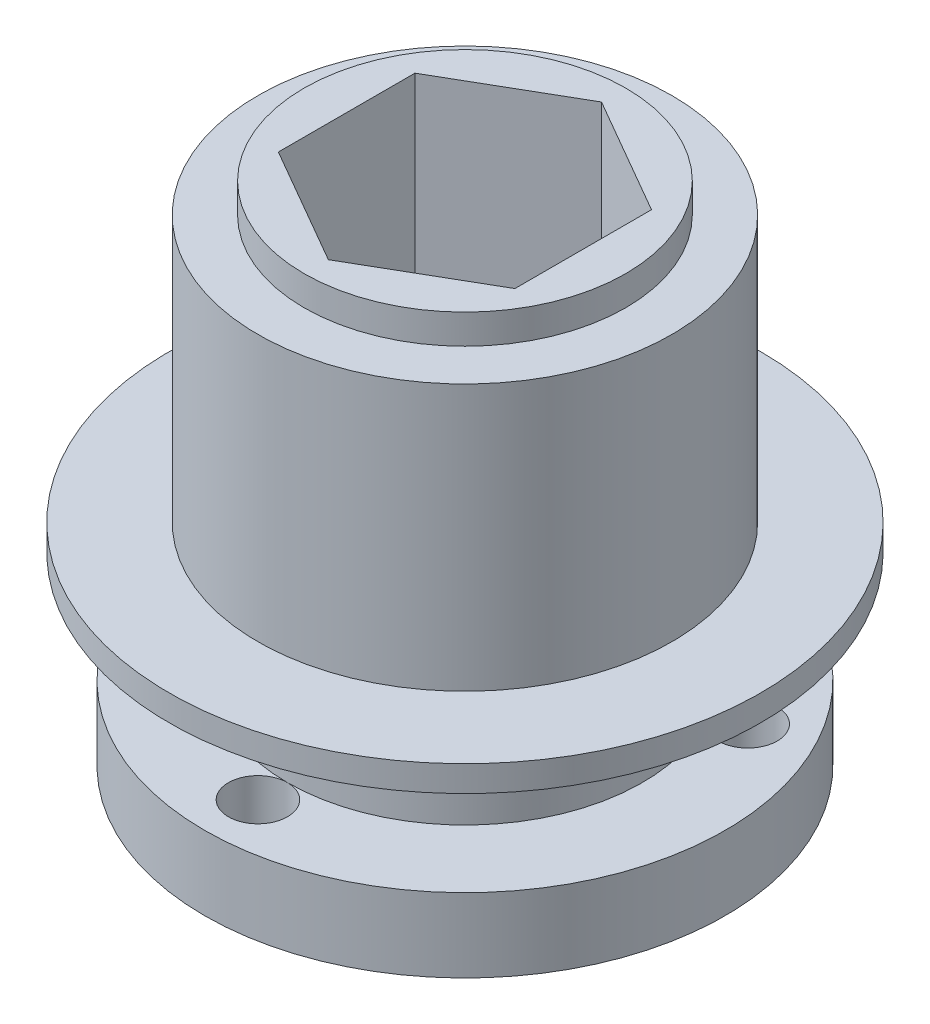
ISO-10303-21;
HEADER;
FILE_DESCRIPTION(('STEP AP214'),'2;1');
FILE_NAME('part.step','',(''),(''),'','','');
FILE_SCHEMA(('AUTOMOTIVE_DESIGN { 1 0 10303 214 1 1 1 1 }'));
ENDSEC;
DATA;
#1=APPLICATION_CONTEXT('core data for automotive mechanical design processes');
#2=APPLICATION_PROTOCOL_DEFINITION('international standard','automotive_design',2000,#1);
#3=PRODUCT_CONTEXT('',#1,'mechanical');
#4=PRODUCT('Part','Part','',(#3));
#5=PRODUCT_RELATED_PRODUCT_CATEGORY('part','',(#4));
#6=PRODUCT_DEFINITION_FORMATION('','',#4);
#7=PRODUCT_DEFINITION_CONTEXT('part definition',#1,'design');
#8=PRODUCT_DEFINITION('design','',#6,#7);
#9=PRODUCT_DEFINITION_SHAPE('','',#8);
#10=(LENGTH_UNIT() NAMED_UNIT(*) SI_UNIT(.MILLI.,.METRE.));
#11=(NAMED_UNIT(*) PLANE_ANGLE_UNIT() SI_UNIT($,.RADIAN.));
#12=(NAMED_UNIT(*) SI_UNIT($,.STERADIAN.) SOLID_ANGLE_UNIT());
#13=UNCERTAINTY_MEASURE_WITH_UNIT(LENGTH_MEASURE(1.E-05),#10,'distance_accuracy_value','');
#14=(GEOMETRIC_REPRESENTATION_CONTEXT(3) GLOBAL_UNCERTAINTY_ASSIGNED_CONTEXT((#13)) GLOBAL_UNIT_ASSIGNED_CONTEXT((#10,
#11,#12)) REPRESENTATION_CONTEXT('',''));
#15=CARTESIAN_POINT('',(0.,0.,0.));
#16=DIRECTION('',(0.,0.,1.));
#17=DIRECTION('',(1.,0.,0.));
#18=AXIS2_PLACEMENT_3D('',#15,#16,#17);
#19=CARTESIAN_POINT('',(0.,0.,0.));
#20=DIRECTION('',(0.,-1.,0.));
#21=DIRECTION('',(0.,0.,-1.));
#22=AXIS2_PLACEMENT_3D('',#19,#20,#21);
#23=PLANE('',#22);
#24=CARTESIAN_POINT('',(0.,0.,22.225));
#25=DIRECTION('',(0.,-1.,0.));
#26=DIRECTION('',(0.,0.,-1.));
#27=AXIS2_PLACEMENT_3D('',#24,#25,#26);
#28=CIRCLE('',#27,3.175);
#29=CARTESIAN_POINT('',(0.,0.,19.05));
#30=VERTEX_POINT('',#29);
#31=EDGE_CURVE('E203',#30,#30,#28,.T.);
#32=ORIENTED_EDGE('',*,*,#31,.F.);
#33=EDGE_LOOP('',(#32));
#34=FACE_BOUND('',#33,.T.);
#35=CARTESIAN_POINT('',(19.2474145991106,0.,-11.1124999999992));
#36=DIRECTION('',(0.,-1.,0.));
#37=DIRECTION('',(0.,0.,-1.));
#38=AXIS2_PLACEMENT_3D('',#35,#36,#37);
#39=CIRCLE('',#38,3.17500000000122);
#40=CARTESIAN_POINT('',(19.2474145991106,0.,-14.2875000000004));
#41=VERTEX_POINT('',#40);
#42=EDGE_CURVE('E207',#41,#41,#39,.T.);
#43=ORIENTED_EDGE('',*,*,#42,.F.);
#44=EDGE_LOOP('',(#43));
#45=FACE_BOUND('',#44,.T.);
#46=CARTESIAN_POINT('',(-19.2474145991077,0.,-11.1125000000008));
#47=DIRECTION('',(0.,-1.,0.));
#48=DIRECTION('',(0.,0.,-1.));
#49=AXIS2_PLACEMENT_3D('',#46,#47,#48);
#50=CIRCLE('',#49,3.17500000000179);
#51=CARTESIAN_POINT('',(-19.2474145991077,0.,-14.2875000000026));
#52=VERTEX_POINT('',#51);
#53=EDGE_CURVE('E204',#52,#52,#50,.T.);
#54=ORIENTED_EDGE('',*,*,#53,.F.);
#55=EDGE_LOOP('',(#54));
#56=FACE_BOUND('',#55,.T.);
#57=DIRECTION('',(0.,0.,1.));
#58=VECTOR('',#57,1.);
#59=CARTESIAN_POINT('',(12.7,0.,-7.33234841870825));
#60=LINE('',#59,#58);
#61=CARTESIAN_POINT('',(12.7,0.,-7.33234841870825));
#62=VERTEX_POINT('',#61);
#63=CARTESIAN_POINT('',(12.7,0.,7.33234841870825));
#64=VERTEX_POINT('',#63);
#65=EDGE_CURVE('E118',#62,#64,#60,.T.);
#66=ORIENTED_EDGE('',*,*,#65,.F.);
#67=DIRECTION('',(0.866025403784439,0.,0.5));
#68=VECTOR('',#67,1.);
#69=CARTESIAN_POINT('',(0.,0.,-14.6646968374165));
#70=LINE('',#69,#68);
#71=CARTESIAN_POINT('',(0.,0.,-14.6646968374165));
#72=VERTEX_POINT('',#71);
#73=EDGE_CURVE('E131',#72,#62,#70,.T.);
#74=ORIENTED_EDGE('',*,*,#73,.F.);
#75=DIRECTION('',(0.866025403784439,0.,-0.5));
#76=VECTOR('',#75,1.);
#77=CARTESIAN_POINT('',(-12.7,0.,-7.33234841870825));
#78=LINE('',#77,#76);
#79=CARTESIAN_POINT('',(-12.7,0.,-7.33234841870825));
#80=VERTEX_POINT('',#79);
#81=EDGE_CURVE('E125',#80,#72,#78,.T.);
#82=ORIENTED_EDGE('',*,*,#81,.F.);
#83=DIRECTION('',(0.,0.,-1.));
#84=VECTOR('',#83,1.);
#85=CARTESIAN_POINT('',(-12.7,0.,7.33234841870825));
#86=LINE('',#85,#84);
#87=CARTESIAN_POINT('',(-12.7,0.,7.33234841870825));
#88=VERTEX_POINT('',#87);
#89=EDGE_CURVE('E123',#88,#80,#86,.T.);
#90=ORIENTED_EDGE('',*,*,#89,.F.);
#91=DIRECTION('',(-0.866025403784439,0.,-0.5));
#92=VECTOR('',#91,1.);
#93=CARTESIAN_POINT('',(0.,0.,14.6646968374165));
#94=LINE('',#93,#92);
#95=CARTESIAN_POINT('',(0.,0.,14.6646968374165));
#96=VERTEX_POINT('',#95);
#97=EDGE_CURVE('E102',#96,#88,#94,.T.);
#98=ORIENTED_EDGE('',*,*,#97,.F.);
#99=DIRECTION('',(-0.866025403784439,0.,0.5));
#100=VECTOR('',#99,1.);
#101=CARTESIAN_POINT('',(12.7,0.,7.33234841870825));
#102=LINE('',#101,#100);
#103=EDGE_CURVE('E113',#64,#96,#102,.T.);
#104=ORIENTED_EDGE('',*,*,#103,.F.);
#105=EDGE_LOOP('',(#66,#74,#82,#90,#98,#104));
#106=FACE_BOUND('',#105,.T.);
#107=CARTESIAN_POINT('',(0.,0.,0.));
#108=DIRECTION('',(0.,-1.,0.));
#109=DIRECTION('',(0.,0.,-1.));
#110=AXIS2_PLACEMENT_3D('',#107,#108,#109);
#111=CIRCLE('',#110,27.94);
#112=CARTESIAN_POINT('',(0.,0.,-27.94));
#113=VERTEX_POINT('',#112);
#114=EDGE_CURVE('E171',#113,#113,#111,.T.);
#115=ORIENTED_EDGE('',*,*,#114,.T.);
#116=EDGE_LOOP('',(#115));
#117=FACE_BOUND('',#116,.T.);
#118=ADVANCED_FACE('F39',(#34,#45,#56,#106,#117),#23,.T.);
#119=CARTESIAN_POINT('',(0.,0.,0.));
#120=DIRECTION('',(0.,-1.,0.));
#121=DIRECTION('',(0.,0.,-1.));
#122=AXIS2_PLACEMENT_3D('',#119,#120,#121);
#123=CYLINDRICAL_SURFACE('',#122,27.94);
#124=CARTESIAN_POINT('',(0.,7.9375,0.));
#125=DIRECTION('',(0.,-1.,0.));
#126=DIRECTION('',(0.,0.,-1.));
#127=AXIS2_PLACEMENT_3D('',#124,#125,#126);
#128=CIRCLE('',#127,27.94);
#129=CARTESIAN_POINT('',(0.,7.9375,-27.94));
#130=VERTEX_POINT('',#129);
#131=EDGE_CURVE('E167',#130,#130,#128,.T.);
#132=ORIENTED_EDGE('',*,*,#131,.T.);
#133=EDGE_LOOP('',(#132));
#134=FACE_BOUND('',#133,.T.);
#135=ORIENTED_EDGE('',*,*,#114,.F.);
#136=EDGE_LOOP('',(#135));
#137=FACE_BOUND('',#136,.T.);
#138=ADVANCED_FACE('F217',(#134,#137),#123,.T.);
#139=CARTESIAN_POINT('',(27.94,7.9375,0.));
#140=DIRECTION('',(0.,1.,0.));
#141=DIRECTION('',(0.,0.,1.));
#142=AXIS2_PLACEMENT_3D('',#139,#140,#141);
#143=PLANE('',#142);
#144=CARTESIAN_POINT('',(0.,7.9375,0.));
#145=DIRECTION('',(0.,-1.,0.));
#146=DIRECTION('',(0.,0.,-1.));
#147=AXIS2_PLACEMENT_3D('',#144,#145,#146);
#148=CIRCLE('',#147,19.05);
#149=CARTESIAN_POINT('',(16.4977839420942,7.9375,-9.52499999999895));
#150=VERTEX_POINT('',#149);
#151=CARTESIAN_POINT('',(0.,7.9375,19.05));
#152=VERTEX_POINT('',#151);
#153=EDGE_CURVE('E164',#150,#152,#148,.T.);
#154=ORIENTED_EDGE('',*,*,#153,.T.);
#155=CARTESIAN_POINT('',(0.,7.9375,22.225));
#156=DIRECTION('',(0.,1.,0.));
#157=DIRECTION('',(0.,0.,1.));
#158=AXIS2_PLACEMENT_3D('',#155,#156,#157);
#159=CIRCLE('',#158,3.175);
#160=EDGE_CURVE('E56',#152,#152,#159,.T.);
#161=ORIENTED_EDGE('',*,*,#160,.F.);
#162=CARTESIAN_POINT('',(-16.4977839420929,7.9375,-9.52500000000106));
#163=VERTEX_POINT('',#162);
#164=EDGE_CURVE('E168',#152,#163,#148,.T.);
#165=ORIENTED_EDGE('',*,*,#164,.T.);
#166=CARTESIAN_POINT('',(-19.2474145991077,7.9375,-11.1125000000008));
#167=DIRECTION('',(0.,1.,0.));
#168=DIRECTION('',(0.,0.,1.));
#169=AXIS2_PLACEMENT_3D('',#166,#167,#168);
#170=CIRCLE('',#169,3.17500000000179);
#171=EDGE_CURVE('E51',#163,#163,#170,.T.);
#172=ORIENTED_EDGE('',*,*,#171,.F.);
#173=EDGE_CURVE('E163',#163,#150,#148,.T.);
#174=ORIENTED_EDGE('',*,*,#173,.T.);
#175=CARTESIAN_POINT('',(19.2474145991106,7.9375,-11.1124999999992));
#176=DIRECTION('',(0.,1.,0.));
#177=DIRECTION('',(0.,0.,1.));
#178=AXIS2_PLACEMENT_3D('',#175,#176,#177);
#179=CIRCLE('',#178,3.17500000000122);
#180=EDGE_CURVE('E198',#150,#150,#179,.T.);
#181=ORIENTED_EDGE('',*,*,#180,.F.);
#182=EDGE_LOOP('',(#154,#161,#165,#172,#174,#181));
#183=FACE_BOUND('',#182,.T.);
#184=ORIENTED_EDGE('',*,*,#131,.F.);
#185=EDGE_LOOP('',(#184));
#186=FACE_BOUND('',#185,.T.);
#187=ADVANCED_FACE('F275',(#183,#186),#143,.T.);
#188=CARTESIAN_POINT('',(0.,0.,0.));
#189=DIRECTION('',(0.,-1.,0.));
#190=DIRECTION('',(0.,0.,-1.));
#191=AXIS2_PLACEMENT_3D('',#188,#189,#190);
#192=CYLINDRICAL_SURFACE('',#191,19.05);
#193=ORIENTED_EDGE('',*,*,#164,.F.);
#194=ORIENTED_EDGE('',*,*,#153,.F.);
#195=ORIENTED_EDGE('',*,*,#173,.F.);
#196=EDGE_LOOP('',(#193,#194,#195));
#197=FACE_BOUND('',#196,.T.);
#198=CARTESIAN_POINT('',(0.,19.84375,0.));
#199=DIRECTION('',(0.,-1.,0.));
#200=DIRECTION('',(0.,0.,-1.));
#201=AXIS2_PLACEMENT_3D('',#198,#199,#200);
#202=CIRCLE('',#201,19.05);
#203=CARTESIAN_POINT('',(0.,19.84375,-19.05));
#204=VERTEX_POINT('',#203);
#205=EDGE_CURVE('E160',#204,#204,#202,.T.);
#206=ORIENTED_EDGE('',*,*,#205,.T.);
#207=EDGE_LOOP('',(#206));
#208=FACE_BOUND('',#207,.T.);
#209=ADVANCED_FACE('F271',(#197,#208),#192,.T.);
#210=CARTESIAN_POINT('',(19.05,19.84375,0.));
#211=DIRECTION('',(0.,-1.,0.));
#212=DIRECTION('',(0.,0.,-1.));
#213=AXIS2_PLACEMENT_3D('',#210,#211,#212);
#214=PLANE('',#213);
#215=CARTESIAN_POINT('',(0.,19.84375,0.));
#216=DIRECTION('',(0.,-1.,0.));
#217=DIRECTION('',(0.,0.,-1.));
#218=AXIS2_PLACEMENT_3D('',#215,#216,#217);
#219=CIRCLE('',#218,31.75);
#220=CARTESIAN_POINT('',(0.,19.84375,-31.75));
#221=VERTEX_POINT('',#220);
#222=EDGE_CURVE('E157',#221,#221,#219,.T.);
#223=ORIENTED_EDGE('',*,*,#222,.T.);
#224=EDGE_LOOP('',(#223));
#225=FACE_BOUND('',#224,.T.);
#226=ORIENTED_EDGE('',*,*,#205,.F.);
#227=EDGE_LOOP('',(#226));
#228=FACE_BOUND('',#227,.T.);
#229=ADVANCED_FACE('F267',(#225,#228),#214,.T.);
#230=CARTESIAN_POINT('',(0.,0.,0.));
#231=DIRECTION('',(0.,-1.,0.));
#232=DIRECTION('',(0.,0.,-1.));
#233=AXIS2_PLACEMENT_3D('',#230,#231,#232);
#234=CYLINDRICAL_SURFACE('',#233,31.75);
#235=CARTESIAN_POINT('',(0.,22.621875,0.));
#236=DIRECTION('',(0.,-1.,0.));
#237=DIRECTION('',(0.,0.,-1.));
#238=AXIS2_PLACEMENT_3D('',#235,#236,#237);
#239=CIRCLE('',#238,31.75);
#240=CARTESIAN_POINT('',(0.,22.621875,-31.75));
#241=VERTEX_POINT('',#240);
#242=EDGE_CURVE('E154',#241,#241,#239,.T.);
#243=ORIENTED_EDGE('',*,*,#242,.T.);
#244=EDGE_LOOP('',(#243));
#245=FACE_BOUND('',#244,.T.);
#246=ORIENTED_EDGE('',*,*,#222,.F.);
#247=EDGE_LOOP('',(#246));
#248=FACE_BOUND('',#247,.T.);
#249=ADVANCED_FACE('F263',(#245,#248),#234,.T.);
#250=CARTESIAN_POINT('',(31.75,22.621875,0.));
#251=DIRECTION('',(0.,1.,0.));
#252=DIRECTION('',(0.,0.,1.));
#253=AXIS2_PLACEMENT_3D('',#250,#251,#252);
#254=PLANE('',#253);
#255=CARTESIAN_POINT('',(0.,22.621875,0.));
#256=DIRECTION('',(0.,-1.,0.));
#257=DIRECTION('',(0.,0.,-1.));
#258=AXIS2_PLACEMENT_3D('',#255,#256,#257);
#259=CIRCLE('',#258,22.225);
#260=CARTESIAN_POINT('',(0.,22.621875,-22.225));
#261=VERTEX_POINT('',#260);
#262=EDGE_CURVE('E151',#261,#261,#259,.T.);
#263=ORIENTED_EDGE('',*,*,#262,.T.);
#264=EDGE_LOOP('',(#263));
#265=FACE_BOUND('',#264,.T.);
#266=ORIENTED_EDGE('',*,*,#242,.F.);
#267=EDGE_LOOP('',(#266));
#268=FACE_BOUND('',#267,.T.);
#269=ADVANCED_FACE('F259',(#265,#268),#254,.T.);
#270=CARTESIAN_POINT('',(0.,0.,0.));
#271=DIRECTION('',(0.,-1.,0.));
#272=DIRECTION('',(0.,0.,-1.));
#273=AXIS2_PLACEMENT_3D('',#270,#271,#272);
#274=CYLINDRICAL_SURFACE('',#273,22.225);
#275=CARTESIAN_POINT('',(0.,51.196875,0.));
#276=DIRECTION('',(0.,-1.,0.));
#277=DIRECTION('',(0.,0.,-1.));
#278=AXIS2_PLACEMENT_3D('',#275,#276,#277);
#279=CIRCLE('',#278,22.225);
#280=CARTESIAN_POINT('',(0.,51.196875,-22.225));
#281=VERTEX_POINT('',#280);
#282=EDGE_CURVE('E148',#281,#281,#279,.T.);
#283=ORIENTED_EDGE('',*,*,#282,.T.);
#284=EDGE_LOOP('',(#283));
#285=FACE_BOUND('',#284,.T.);
#286=ORIENTED_EDGE('',*,*,#262,.F.);
#287=EDGE_LOOP('',(#286));
#288=FACE_BOUND('',#287,.T.);
#289=ADVANCED_FACE('F255',(#285,#288),#274,.T.);
#290=CARTESIAN_POINT('',(22.225,51.196875,0.));
#291=DIRECTION('',(0.,1.,0.));
#292=DIRECTION('',(0.,0.,1.));
#293=AXIS2_PLACEMENT_3D('',#290,#291,#292);
#294=PLANE('',#293);
#295=CARTESIAN_POINT('',(0.,51.196875,0.));
#296=DIRECTION('',(0.,-1.,0.));
#297=DIRECTION('',(0.,0.,-1.));
#298=AXIS2_PLACEMENT_3D('',#295,#296,#297);
#299=CIRCLE('',#298,17.2640625);
#300=CARTESIAN_POINT('',(0.,51.196875,-17.2640625));
#301=VERTEX_POINT('',#300);
#302=EDGE_CURVE('E145',#301,#301,#299,.T.);
#303=ORIENTED_EDGE('',*,*,#302,.T.);
#304=EDGE_LOOP('',(#303));
#305=FACE_BOUND('',#304,.T.);
#306=ORIENTED_EDGE('',*,*,#282,.F.);
#307=EDGE_LOOP('',(#306));
#308=FACE_BOUND('',#307,.T.);
#309=ADVANCED_FACE('F251',(#305,#308),#294,.T.);
#310=CARTESIAN_POINT('',(0.,0.,0.));
#311=DIRECTION('',(0.,-1.,0.));
#312=DIRECTION('',(0.,0.,-1.));
#313=AXIS2_PLACEMENT_3D('',#310,#311,#312);
#314=CYLINDRICAL_SURFACE('',#313,17.2640625);
#315=CARTESIAN_POINT('',(0.,54.371875,0.));
#316=DIRECTION('',(0.,-1.,0.));
#317=DIRECTION('',(0.,0.,-1.));
#318=AXIS2_PLACEMENT_3D('',#315,#316,#317);
#319=CIRCLE('',#318,17.2640625);
#320=CARTESIAN_POINT('',(0.,54.371875,-17.2640625));
#321=VERTEX_POINT('',#320);
#322=EDGE_CURVE('E136',#321,#321,#319,.T.);
#323=ORIENTED_EDGE('',*,*,#322,.T.);
#324=EDGE_LOOP('',(#323));
#325=FACE_BOUND('',#324,.T.);
#326=ORIENTED_EDGE('',*,*,#302,.F.);
#327=EDGE_LOOP('',(#326));
#328=FACE_BOUND('',#327,.T.);
#329=ADVANCED_FACE('F248',(#325,#328),#314,.T.);
#330=CARTESIAN_POINT('',(17.2640625,54.371875,0.));
#331=DIRECTION('',(0.,1.,0.));
#332=DIRECTION('',(0.,0.,1.));
#333=AXIS2_PLACEMENT_3D('',#330,#331,#332);
#334=PLANE('',#333);
#335=DIRECTION('',(0.,0.,-1.));
#336=VECTOR('',#335,1.);
#337=CARTESIAN_POINT('',(12.7,54.371875,0.));
#338=LINE('',#337,#336);
#339=CARTESIAN_POINT('',(12.7,54.371875,7.33234841870825));
#340=VERTEX_POINT('',#339);
#341=CARTESIAN_POINT('',(12.7,54.371875,-7.33234841870825));
#342=VERTEX_POINT('',#341);
#343=EDGE_CURVE('E11',#340,#342,#338,.T.);
#344=ORIENTED_EDGE('',*,*,#343,.F.);
#345=DIRECTION('',(0.866025403784439,0.,-0.5));
#346=VECTOR('',#345,1.);
#347=CARTESIAN_POINT('',(19.298046875,54.371875,3.52296427930123));
#348=LINE('',#347,#346);
#349=CARTESIAN_POINT('',(0.,54.371875,14.6646968374165));
#350=VERTEX_POINT('',#349);
#351=EDGE_CURVE('E174',#350,#340,#348,.T.);
#352=ORIENTED_EDGE('',*,*,#351,.F.);
#353=DIRECTION('',(0.866025403784439,0.,0.5));
#354=VECTOR('',#353,1.);
#355=CARTESIAN_POINT('',(6.59804687500001,54.371875,18.4740809768235));
#356=LINE('',#355,#354);
#357=CARTESIAN_POINT('',(-12.7,54.371875,7.33234841870825));
#358=VERTEX_POINT('',#357);
#359=EDGE_CURVE('E105',#358,#350,#356,.T.);
#360=ORIENTED_EDGE('',*,*,#359,.F.);
#361=DIRECTION('',(0.,0.,1.));
#362=VECTOR('',#361,1.);
#363=CARTESIAN_POINT('',(-12.7,54.371875,0.));
#364=LINE('',#363,#362);
#365=CARTESIAN_POINT('',(-12.7,54.371875,-7.33234841870825));
#366=VERTEX_POINT('',#365);
#367=EDGE_CURVE('E177',#366,#358,#364,.T.);
#368=ORIENTED_EDGE('',*,*,#367,.F.);
#369=DIRECTION('',(-0.866025403784439,0.,0.5));
#370=VECTOR('',#369,1.);
#371=CARTESIAN_POINT('',(6.598046875,54.371875,-18.4740809768235));
#372=LINE('',#371,#370);
#373=CARTESIAN_POINT('',(0.,54.371875,-14.6646968374165));
#374=VERTEX_POINT('',#373);
#375=EDGE_CURVE('E179',#374,#366,#372,.T.);
#376=ORIENTED_EDGE('',*,*,#375,.F.);
#377=DIRECTION('',(-0.866025403784439,0.,-0.5));
#378=VECTOR('',#377,1.);
#379=CARTESIAN_POINT('',(19.298046875,54.371875,-3.52296427930123));
#380=LINE('',#379,#378);
#381=EDGE_CURVE('E46',#342,#374,#380,.T.);
#382=ORIENTED_EDGE('',*,*,#381,.F.);
#383=EDGE_LOOP('',(#344,#352,#360,#368,#376,#382));
#384=FACE_BOUND('',#383,.T.);
#385=ORIENTED_EDGE('',*,*,#322,.F.);
#386=EDGE_LOOP('',(#385));
#387=FACE_BOUND('',#386,.T.);
#388=ADVANCED_FACE('F193',(#384,#387),#334,.T.);
#389=CARTESIAN_POINT('',(12.7,101.6,-7.33234841870825));
#390=DIRECTION('',(1.,0.,0.));
#391=DIRECTION('',(0.,0.,-1.));
#392=AXIS2_PLACEMENT_3D('',#389,#390,#391);
#393=PLANE('',#392);
#394=ORIENTED_EDGE('',*,*,#343,.T.);
#395=DIRECTION('',(0.,-1.,0.));
#396=VECTOR('',#395,1.);
#397=CARTESIAN_POINT('',(12.7,101.6,-7.33234841870825));
#398=LINE('',#397,#396);
#399=EDGE_CURVE('E134',#342,#62,#398,.T.);
#400=ORIENTED_EDGE('',*,*,#399,.T.);
#401=ORIENTED_EDGE('',*,*,#65,.T.);
#402=DIRECTION('',(0.,-1.,0.));
#403=VECTOR('',#402,1.);
#404=CARTESIAN_POINT('',(12.7,101.6,7.33234841870825));
#405=LINE('',#404,#403);
#406=EDGE_CURVE('E109',#340,#64,#405,.T.);
#407=ORIENTED_EDGE('',*,*,#406,.F.);
#408=EDGE_LOOP('',(#394,#400,#401,#407));
#409=FACE_BOUND('',#408,.T.);
#410=ADVANCED_FACE('F237',(#409),#393,.F.);
#411=CARTESIAN_POINT('',(0.,101.6,-14.6646968374165));
#412=DIRECTION('',(0.5,0.,-0.866025403784439));
#413=DIRECTION('',(-0.866025403784439,0.,-0.5));
#414=AXIS2_PLACEMENT_3D('',#411,#412,#413);
#415=PLANE('',#414);
#416=ORIENTED_EDGE('',*,*,#381,.T.);
#417=DIRECTION('',(0.,-1.,0.));
#418=VECTOR('',#417,1.);
#419=CARTESIAN_POINT('',(0.,101.6,-14.6646968374165));
#420=LINE('',#419,#418);
#421=EDGE_CURVE('E137',#374,#72,#420,.T.);
#422=ORIENTED_EDGE('',*,*,#421,.T.);
#423=ORIENTED_EDGE('',*,*,#73,.T.);
#424=ORIENTED_EDGE('',*,*,#399,.F.);
#425=EDGE_LOOP('',(#416,#422,#423,#424));
#426=FACE_BOUND('',#425,.T.);
#427=ADVANCED_FACE('F184',(#426),#415,.F.);
#428=CARTESIAN_POINT('',(-12.7,101.6,-7.33234841870825));
#429=DIRECTION('',(-0.5,0.,-0.866025403784439));
#430=DIRECTION('',(-0.866025403784439,0.,0.5));
#431=AXIS2_PLACEMENT_3D('',#428,#429,#430);
#432=PLANE('',#431);
#433=ORIENTED_EDGE('',*,*,#375,.T.);
#434=DIRECTION('',(0.,-1.,0.));
#435=VECTOR('',#434,1.);
#436=CARTESIAN_POINT('',(-12.7,101.6,-7.33234841870825));
#437=LINE('',#436,#435);
#438=EDGE_CURVE('E139',#366,#80,#437,.T.);
#439=ORIENTED_EDGE('',*,*,#438,.T.);
#440=ORIENTED_EDGE('',*,*,#81,.T.);
#441=ORIENTED_EDGE('',*,*,#421,.F.);
#442=EDGE_LOOP('',(#433,#439,#440,#441));
#443=FACE_BOUND('',#442,.T.);
#444=ADVANCED_FACE('F189',(#443),#432,.F.);
#445=CARTESIAN_POINT('',(-12.7,101.6,7.33234841870825));
#446=DIRECTION('',(-1.,0.,0.));
#447=DIRECTION('',(0.,0.,1.));
#448=AXIS2_PLACEMENT_3D('',#445,#446,#447);
#449=PLANE('',#448);
#450=ORIENTED_EDGE('',*,*,#367,.T.);
#451=DIRECTION('',(0.,-1.,0.));
#452=VECTOR('',#451,1.);
#453=CARTESIAN_POINT('',(-12.7,101.6,7.33234841870825));
#454=LINE('',#453,#452);
#455=EDGE_CURVE('E108',#358,#88,#454,.T.);
#456=ORIENTED_EDGE('',*,*,#455,.T.);
#457=ORIENTED_EDGE('',*,*,#89,.T.);
#458=ORIENTED_EDGE('',*,*,#438,.F.);
#459=EDGE_LOOP('',(#450,#456,#457,#458));
#460=FACE_BOUND('',#459,.T.);
#461=ADVANCED_FACE('F196',(#460),#449,.F.);
#462=CARTESIAN_POINT('',(0.,101.6,14.6646968374165));
#463=DIRECTION('',(-0.5,0.,0.866025403784439));
#464=DIRECTION('',(0.866025403784439,0.,0.5));
#465=AXIS2_PLACEMENT_3D('',#462,#463,#464);
#466=PLANE('',#465);
#467=ORIENTED_EDGE('',*,*,#359,.T.);
#468=DIRECTION('',(0.,-1.,0.));
#469=VECTOR('',#468,1.);
#470=CARTESIAN_POINT('',(0.,101.6,14.6646968374165));
#471=LINE('',#470,#469);
#472=EDGE_CURVE('E97',#350,#96,#471,.T.);
#473=ORIENTED_EDGE('',*,*,#472,.T.);
#474=ORIENTED_EDGE('',*,*,#97,.T.);
#475=ORIENTED_EDGE('',*,*,#455,.F.);
#476=EDGE_LOOP('',(#467,#473,#474,#475));
#477=FACE_BOUND('',#476,.T.);
#478=ADVANCED_FACE('F99',(#477),#466,.F.);
#479=CARTESIAN_POINT('',(12.7,101.6,7.33234841870825));
#480=DIRECTION('',(0.5,0.,0.866025403784439));
#481=DIRECTION('',(0.866025403784439,0.,-0.5));
#482=AXIS2_PLACEMENT_3D('',#479,#480,#481);
#483=PLANE('',#482);
#484=ORIENTED_EDGE('',*,*,#351,.T.);
#485=ORIENTED_EDGE('',*,*,#406,.T.);
#486=ORIENTED_EDGE('',*,*,#103,.T.);
#487=ORIENTED_EDGE('',*,*,#472,.F.);
#488=EDGE_LOOP('',(#484,#485,#486,#487));
#489=FACE_BOUND('',#488,.T.);
#490=ADVANCED_FACE('F114',(#489),#483,.F.);
#491=CARTESIAN_POINT('',(-19.2474145991077,12.7,-11.1125000000008));
#492=DIRECTION('',(0.,-1.,0.));
#493=DIRECTION('',(0.,0.,-1.));
#494=AXIS2_PLACEMENT_3D('',#491,#492,#493);
#495=CYLINDRICAL_SURFACE('',#494,3.17500000000179);
#496=ORIENTED_EDGE('',*,*,#171,.T.);
#497=EDGE_LOOP('',(#496));
#498=FACE_BOUND('',#497,.T.);
#499=ORIENTED_EDGE('',*,*,#53,.T.);
#500=EDGE_LOOP('',(#499));
#501=FACE_BOUND('',#500,.T.);
#502=ADVANCED_FACE('F222',(#498,#501),#495,.F.);
#503=CARTESIAN_POINT('',(19.2474145991106,12.7,-11.1124999999992));
#504=DIRECTION('',(0.,-1.,0.));
#505=DIRECTION('',(0.,0.,-1.));
#506=AXIS2_PLACEMENT_3D('',#503,#504,#505);
#507=CYLINDRICAL_SURFACE('',#506,3.17500000000122);
#508=ORIENTED_EDGE('',*,*,#180,.T.);
#509=EDGE_LOOP('',(#508));
#510=FACE_BOUND('',#509,.T.);
#511=ORIENTED_EDGE('',*,*,#42,.T.);
#512=EDGE_LOOP('',(#511));
#513=FACE_BOUND('',#512,.T.);
#514=ADVANCED_FACE('F224',(#510,#513),#507,.F.);
#515=CARTESIAN_POINT('',(0.,12.7,22.225));
#516=DIRECTION('',(0.,-1.,0.));
#517=DIRECTION('',(0.,0.,-1.));
#518=AXIS2_PLACEMENT_3D('',#515,#516,#517);
#519=CYLINDRICAL_SURFACE('',#518,3.175);
#520=ORIENTED_EDGE('',*,*,#160,.T.);
#521=EDGE_LOOP('',(#520));
#522=FACE_BOUND('',#521,.T.);
#523=ORIENTED_EDGE('',*,*,#31,.T.);
#524=EDGE_LOOP('',(#523));
#525=FACE_BOUND('',#524,.T.);
#526=ADVANCED_FACE('F213',(#522,#525),#519,.F.);
#527=CLOSED_SHELL('',(#118,#138,#187,#209,#229,#249,#269,#289,#309,#329,#388,#410,#427,#444,
#461,#478,#490,#502,#514,#526));
#528=MANIFOLD_SOLID_BREP('B2',#527);
#529=ADVANCED_BREP_SHAPE_REPRESENTATION('',(#18,#528),#14);
#530=SHAPE_DEFINITION_REPRESENTATION(#9,#529);
ENDSEC;
END-ISO-10303-21;
